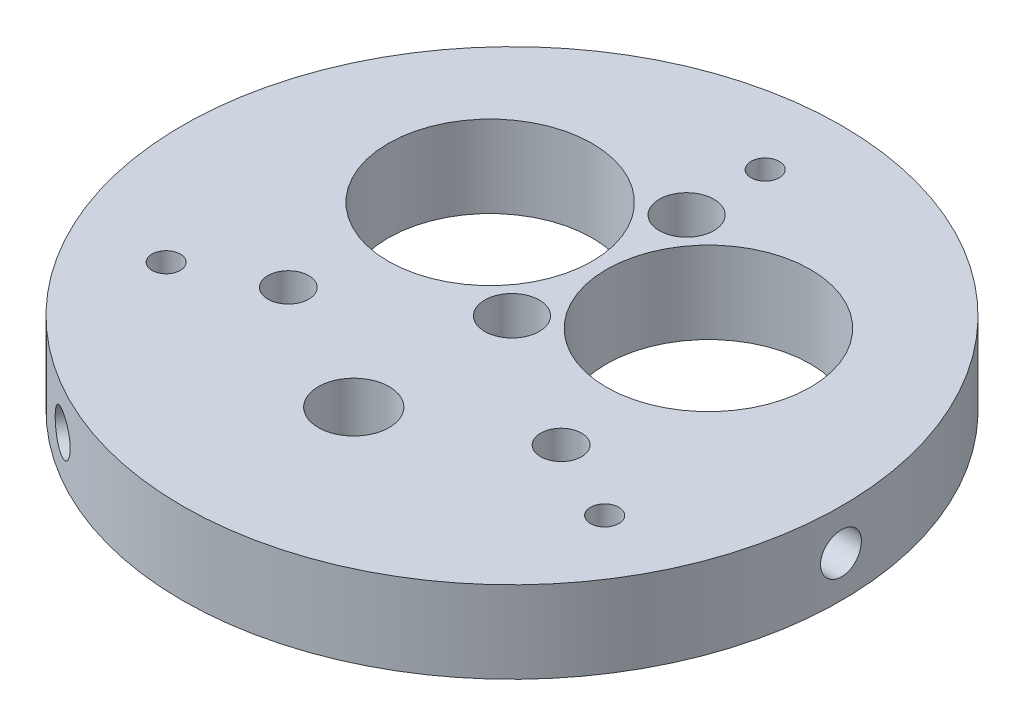
ISO-10303-21;
HEADER;
FILE_DESCRIPTION(('STEP AP214'),'2;1');
FILE_NAME('part.step','',(''),(''),'','','');
FILE_SCHEMA(('AUTOMOTIVE_DESIGN { 1 0 10303 214 1 1 1 1 }'));
ENDSEC;
DATA;
#1=APPLICATION_CONTEXT('core data for automotive mechanical design processes');
#2=APPLICATION_PROTOCOL_DEFINITION('international standard','automotive_design',2000,#1);
#3=PRODUCT_CONTEXT('',#1,'mechanical');
#4=PRODUCT('Part','Part','',(#3));
#5=PRODUCT_RELATED_PRODUCT_CATEGORY('part','',(#4));
#6=PRODUCT_DEFINITION_FORMATION('','',#4);
#7=PRODUCT_DEFINITION_CONTEXT('part definition',#1,'design');
#8=PRODUCT_DEFINITION('design','',#6,#7);
#9=PRODUCT_DEFINITION_SHAPE('','',#8);
#10=(LENGTH_UNIT() NAMED_UNIT(*) SI_UNIT(.MILLI.,.METRE.));
#11=(NAMED_UNIT(*) PLANE_ANGLE_UNIT() SI_UNIT($,.RADIAN.));
#12=(NAMED_UNIT(*) SI_UNIT($,.STERADIAN.) SOLID_ANGLE_UNIT());
#13=UNCERTAINTY_MEASURE_WITH_UNIT(LENGTH_MEASURE(1.E-05),#10,'distance_accuracy_value','');
#14=(GEOMETRIC_REPRESENTATION_CONTEXT(3) GLOBAL_UNCERTAINTY_ASSIGNED_CONTEXT((#13)) GLOBAL_UNIT_ASSIGNED_CONTEXT((#10,
#11,#12)) REPRESENTATION_CONTEXT('',''));
#15=CARTESIAN_POINT('',(0.,0.,0.));
#16=DIRECTION('',(0.,0.,1.));
#17=DIRECTION('',(1.,0.,0.));
#18=AXIS2_PLACEMENT_3D('',#15,#16,#17);
#19=CARTESIAN_POINT('',(0.,9.525,0.));
#20=DIRECTION('',(0.,-1.,0.));
#21=DIRECTION('',(0.,0.,-1.));
#22=AXIS2_PLACEMENT_3D('',#19,#20,#21);
#23=CYLINDRICAL_SURFACE('',#22,38.354);
#24=CARTESIAN_POINT('',(38.2804018525146,4.7625,-2.37489999999974));
#25=CARTESIAN_POINT('',(38.2804028373069,4.62923809089192,-2.37489413527671));
#26=CARTESIAN_POINT('',(38.2811052035353,4.49588281019358,-2.36364579205755));
#27=CARTESIAN_POINT('',(38.2838391152481,4.23285434302784,-2.31893528967399));
#28=CARTESIAN_POINT('',(38.2858722087771,4.10318562870893,-2.28544725825875));
#29=CARTESIAN_POINT('',(38.2910364070698,3.85137838047477,-2.19722280005456));
#30=CARTESIAN_POINT('',(38.2941669331792,3.72923591794559,-2.14249756959386));
#31=CARTESIAN_POINT('',(38.3011725260395,3.49590258604333,-2.01337022650416));
#32=CARTESIAN_POINT('',(38.3050474219797,3.38470921301707,-1.93897262662722));
#33=CARTESIAN_POINT('',(38.313111626275,3.17623409838296,-1.77249177631208));
#34=CARTESIAN_POINT('',(38.3173013377438,3.07897067303234,-1.68038560702491));
#35=CARTESIAN_POINT('',(38.3255193340163,2.90127312255655,-1.48114938271447));
#36=CARTESIAN_POINT('',(38.3295476120886,2.82083969861176,-1.37401870204254));
#37=CARTESIAN_POINT('',(38.3369922882502,2.67902969934687,-1.14767193856118));
#38=CARTESIAN_POINT('',(38.3404082021527,2.617668176002,-1.0284464081496));
#39=CARTESIAN_POINT('',(38.3462390227638,2.51584020554425,-0.781360599533002));
#40=CARTESIAN_POINT('',(38.3486539400257,2.47537353813936,-0.653500412378222));
#41=CARTESIAN_POINT('',(38.3522078864978,2.41653451916251,-0.392950312927358));
#42=CARTESIAN_POINT('',(38.3533485636492,2.39813362823547,-0.260266868395284));
#43=CARTESIAN_POINT('',(38.3542310483331,2.38386036623799,0.00631003831127287));
#44=CARTESIAN_POINT('',(38.3539728713895,2.38798774516191,0.14020348704137));
#45=CARTESIAN_POINT('',(38.3520881155161,2.4186303095414,0.405206350489702));
#46=CARTESIAN_POINT('',(38.3504634131721,2.44511479320974,0.536319330484336));
#47=CARTESIAN_POINT('',(38.3460306871079,2.51967212930872,0.792235044756302));
#48=CARTESIAN_POINT('',(38.3432226564961,2.56774510747139,0.917037742277648));
#49=CARTESIAN_POINT('',(38.3367362172293,2.6841495937017,1.15688876407849));
#50=CARTESIAN_POINT('',(38.3330572109929,2.75249501899231,1.27193031723763));
#51=CARTESIAN_POINT('',(38.32524287678,2.90749419472858,1.48891949069444));
#52=CARTESIAN_POINT('',(38.3211075437668,2.99414814726964,1.59086696643552));
#53=CARTESIAN_POINT('',(38.3128377790859,3.18347799568064,1.77895325879296));
#54=CARTESIAN_POINT('',(38.3087033605807,3.28618053913264,1.865065254496));
#55=CARTESIAN_POINT('',(38.3009084798889,3.50459884614974,2.01882939779021));
#56=CARTESIAN_POINT('',(38.2972480178872,3.62031461479223,2.08648153817884));
#57=CARTESIAN_POINT('',(38.2908143984836,3.8614916273744,2.20140364078515));
#58=CARTESIAN_POINT('',(38.2880412899939,3.98695340805489,2.24867247949551));
#59=CARTESIAN_POINT('',(38.2836968563364,4.24405325203897,2.32146770175652));
#60=CARTESIAN_POINT('',(38.2821255172932,4.37569124401501,2.34699433633738));
#61=CARTESIAN_POINT('',(38.2803644239049,4.64117285013254,2.37554713938441));
#62=CARTESIAN_POINT('',(38.2801723805149,4.77501244030647,2.37861058737654));
#63=CARTESIAN_POINT('',(38.2811855558711,5.04130366654735,2.36224745372679));
#64=CARTESIAN_POINT('',(38.2823907674829,5.17375530969764,2.34282098691761));
#65=CARTESIAN_POINT('',(38.2860605414527,5.43340543759909,2.282060435064));
#66=CARTESIAN_POINT('',(38.2885241171049,5.56060795394907,2.24074351377059));
#67=CARTESIAN_POINT('',(38.2944321528365,5.80627343777458,2.13739227430566));
#68=CARTESIAN_POINT('',(38.297876621647,5.92473632744399,2.07535777171928));
#69=CARTESIAN_POINT('',(38.3053638317819,6.14973108341426,1.93223701715204));
#70=CARTESIAN_POINT('',(38.3094073550205,6.25624703183816,1.85112578277772));
#71=CARTESIAN_POINT('',(38.3176342635313,6.45416396797893,1.67219038274789));
#72=CARTESIAN_POINT('',(38.3218176501481,6.54556481031257,1.57436605635746));
#73=CARTESIAN_POINT('',(38.3298595625683,6.71078288610321,1.36462091887382));
#74=CARTESIAN_POINT('',(38.3337176380872,6.7845759977581,1.25268108721998));
#75=CARTESIAN_POINT('',(38.3406677229239,6.91231883823295,1.01797818211948));
#76=CARTESIAN_POINT('',(38.343759736896,6.96626868761152,0.895215174435104));
#77=CARTESIAN_POINT('',(38.3488271428147,7.05275159763808,0.642439443840433));
#78=CARTESIAN_POINT('',(38.350803331031,7.08529993345883,0.512431963669285));
#79=CARTESIAN_POINT('',(38.3534195842414,7.12810588034382,0.248784802508676));
#80=CARTESIAN_POINT('',(38.3540596620933,7.13836370591669,0.115145156485227));
#81=CARTESIAN_POINT('',(38.3539316119804,7.13629537087301,-0.15173399741554));
#82=CARTESIAN_POINT('',(38.3531658382137,7.12400696553796,-0.284973800674045));
#83=CARTESIAN_POINT('',(38.3503168773641,7.07727325897385,-0.547494398021387));
#84=CARTESIAN_POINT('',(38.3482336879553,7.04282791862838,-0.676775185120456));
#85=CARTESIAN_POINT('',(38.3429840573992,6.9527665950289,-0.927713747359896));
#86=CARTESIAN_POINT('',(38.3398176229976,6.89715074360862,-1.04937156996476));
#87=CARTESIAN_POINT('',(38.3327570505148,6.76633244436232,-1.28162755978392));
#88=CARTESIAN_POINT('',(38.3288629314868,6.69113050934785,-1.39222601645454));
#89=CARTESIAN_POINT('',(38.3207772984907,6.52313545836678,-1.59941512264191));
#90=CARTESIAN_POINT('',(38.316585330344,6.43031510026139,-1.6959836649611));
#91=CARTESIAN_POINT('',(38.3083800523644,6.22975362752857,-1.87220132348133));
#92=CARTESIAN_POINT('',(38.3043667865182,6.1220088658622,-1.95184629201958));
#93=CARTESIAN_POINT('',(38.2969677917123,5.89453587654806,-2.0920138541689));
#94=CARTESIAN_POINT('',(38.2935828385411,5.77479311183602,-2.1525128720298));
#95=CARTESIAN_POINT('',(38.2878336952391,5.52691573865806,-2.25247359450052));
#96=CARTESIAN_POINT('',(38.285468309652,5.39879116220686,-2.29195994955248));
#97=CARTESIAN_POINT('',(38.2826463054199,5.18531841211594,-2.3385067489144));
#98=CARTESIAN_POINT('',(38.2818083941843,5.10135027860589,-2.35213658153649));
#99=CARTESIAN_POINT('',(38.2806858540897,4.9324340875067,-2.3703350709771));
#100=CARTESIAN_POINT('',(38.2804012244762,4.84748603125375,-2.37490374014977));
#101=CARTESIAN_POINT('',(38.2804018525146,4.7625,-2.37489999999974));
#102=B_SPLINE_CURVE_WITH_KNOTS('',3,(#24,#25,#26,#27,#28,#29,#30,#31,#32,#33,#34,#35,#36,#37,
#38,#39,#40,#41,#42,#43,#44,#45,#46,#47,#48,#49,#50,#51,#52,#53,#54,#55,#56,#57,#58,#59,#60,#61,
#62,#63,#64,#65,#66,#67,#68,#69,#70,#71,#72,#73,#74,#75,#76,#77,#78,#79,#80,#81,#82,#83,#84,#85,
#86,#87,#88,#89,#90,#91,#92,#93,#94,#95,#96,#97,#98,#99,#100,#101),.UNSPECIFIED.,.T.,.F.,(4,2,2,
2,2,2,2,2,2,2,2,2,2,2,2,2,2,2,2,2,2,2,2,2,2,2,2,2,2,2,2,2,2,2,2,2,2,2,4),(0.,0.399475476302926,
0.799416493165485,1.1991469454962,1.59878578090996,1.99894536307212,2.39912161357537,
2.7996128949367,3.20009995387938,3.60006847169276,4.00003255089726,4.39944827316248,
4.79886632166716,5.19855921151562,5.59825651353268,5.99862467916022,6.3989930010006,
6.79938338792528,7.19976915197735,7.59949029185473,7.99920939077927,8.39861554288699,
8.79802525035158,9.19796095582233,9.59790050781335,9.99838485314969,10.3988667652857,
10.7990625252291,11.1992544339451,11.5987768041428,11.9982998796691,12.3978204673125,
12.7973305955817,13.1974635662305,13.5976944894359,13.9984163444992,14.3986670613082,
14.6534276439034,14.908187879153),.UNSPECIFIED.);
#103=CARTESIAN_POINT('',(38.2804018525146,4.7625,-2.37489999999974));
#104=VERTEX_POINT('',#103);
#105=EDGE_CURVE('E132',#104,#104,#102,.T.);
#106=ORIENTED_EDGE('',*,*,#105,.T.);
#107=EDGE_LOOP('',(#106));
#108=FACE_BOUND('',#107,.T.);
#109=CARTESIAN_POINT('',(-17.08347719481,4.7625,34.3392504713543));
#110=CARTESIAN_POINT('',(-17.0834827662053,4.62923809089192,34.339248391848));
#111=CARTESIAN_POINT('',(-17.0935753002978,4.49588281019358,34.3342324872349));
#112=CARTESIAN_POINT('',(-17.1336626870343,4.23285434302784,34.3142448730381));
#113=CARTESIAN_POINT('',(-17.1636807197271,4.10318562870893,34.2992615679749));
#114=CARTESIAN_POINT('',(-17.2426674409134,3.85137838047477,34.2596216657845));
#115=CARTESIAN_POINT('',(-17.2916261437751,3.72923591794559,34.2349701656921));
#116=CARTESIAN_POINT('',(-17.4069564996441,3.49590258604333,34.1764735155328));
#117=CARTESIAN_POINT('',(-17.4733241590882,3.38470921301707,34.1426304739156));
#118=CARTESIAN_POINT('',(-17.6215329068524,3.17623409838296,34.066373854539));
#119=CARTESIAN_POINT('',(-17.7033940450348,3.07897067303234,34.023949166462));
#120=CARTESIAN_POINT('',(-17.8800466747779,2.90127312255656,33.9314480478469));
#121=CARTESIAN_POINT('',(-17.9748387048007,2.82083969861176,33.8813712986551));
#122=CARTESIAN_POINT('',(-18.1745830901207,2.67902969934687,33.7746451955933));
#123=CARTESIAN_POINT('',(-18.2795433851881,2.617668176002,33.7179906986042));
#124=CARTESIAN_POINT('',(-18.4964413826702,2.51584020554425,33.59949743307));
#125=CARTESIAN_POINT('',(-18.6083790115098,2.47537353813936,33.5376587191895));
#126=CARTESIAN_POINT('',(-18.8357989898289,2.4165345191625,33.4104614773926));
#127=CARTESIAN_POINT('',(-18.951276562031,2.39813362823547,33.3451076105171));
#128=CARTESIAN_POINT('',(-19.1825801776431,2.38386036623799,33.2125834113186));
#129=CARTESIAN_POINT('',(-19.2984062171719,2.38798774516191,33.1454130991617));
#130=CARTESIAN_POINT('',(-19.5269630510571,2.41863030954139,33.0112794209713));
#131=CARTESIAN_POINT('',(-19.6396978713263,2.44511479320974,32.9443158974704));
#132=CARTESIAN_POINT('',(-19.8591110180814,2.51967212930871,32.8125191869549));
#133=CARTESIAN_POINT('',(-19.9657893092898,2.56774510747139,32.7476860123498));
#134=CARTESIAN_POINT('',(-20.1702631676596,2.6841495937017,32.6221430802642));
#135=CARTESIAN_POINT('',(-20.268052572068,2.7524950189923,32.5614361908232));
#136=CARTESIAN_POINT('',(-20.4520635415213,2.90749419472858,32.4461741921528));
#137=CARTESIAN_POINT('',(-20.5382849788582,2.99414814726964,32.3916191508397));
#138=CARTESIAN_POINT('',(-20.6970376038029,3.18347799568064,32.2904141783639));
#139=CARTESIAN_POINT('',(-20.7695455703997,3.28618053913264,32.2437776690571));
#140=CARTESIAN_POINT('',(-20.8988117843378,3.50459884614974,32.1601450327115));
#141=CARTESIAN_POINT('',(-20.9555700255338,3.62031461479223,32.123148909434));
#142=CARTESIAN_POINT('',(-21.0518786761454,3.8614916273744,32.0601161802891));
#143=CARTESIAN_POINT('',(-21.0914281370312,3.98695340805489,32.0340801785344));
#144=CARTESIAN_POINT('',(-21.1522984319546,4.24405325203896,31.9939201774914));
#145=CARTESIAN_POINT('',(-21.1736194764531,4.37569124401501,31.9797960406716));
#146=CARTESIAN_POINT('',(-21.197466382547,4.64117285013254,31.9639944875354));
#147=CARTESIAN_POINT('',(-21.2000233846363,4.77501244030647,31.962296449085));
#148=CARTESIAN_POINT('',(-21.1863590828882,5.04130366654735,31.9713554515068));
#149=CARTESIAN_POINT('',(-21.1701378749316,5.17375530969764,31.9821124287841));
#150=CARTESIAN_POINT('',(-21.1193525804633,5.43340543759909,32.0156708221949));
#151=CARTESIAN_POINT('',(-21.0848028648431,5.56060795394907,32.0384628019406));
#152=CARTESIAN_POINT('',(-20.9982520838197,5.80627343777458,32.0952549307031));
#153=CARTESIAN_POINT('',(-20.946250863074,5.924736327444,32.1292551794887));
#154=CARTESIAN_POINT('',(-20.8260482588774,6.14973108341426,32.2072996709527));
#155=CARTESIAN_POINT('',(-20.7578256309963,6.25624703183816,32.2513570819853));
#156=CARTESIAN_POINT('',(-20.6069764831895,6.45416396797893,32.3479494937651));
#157=CARTESIAN_POINT('',(-20.5243498247357,6.54556481031257,32.4004845760443));
#158=CARTESIAN_POINT('',(-20.3467261635647,6.71078288610321,32.512321645237));
#159=CARTESIAN_POINT('',(-20.2517124634165,6.7845759977581,32.571632752473));
#160=CARTESIAN_POINT('',(-20.0519288276759,6.91231883823295,32.6950031550504));
#161=CARTESIAN_POINT('',(-19.9471589513623,6.96626868761152,32.7590624215412));
#162=CARTESIAN_POINT('',(-19.7307824501664,7.05275159763808,32.8898387890954));
#163=CARTESIAN_POINT('',(-19.6191807637644,7.08529993345883,32.956553958379));
#164=CARTESIAN_POINT('',(-19.3921637511688,7.12810588034382,33.0906432807022));
#165=CARTESIAN_POINT('',(-19.2767484616857,7.13836370591669,33.1580174273941));
#166=CARTESIAN_POINT('',(-19.0455603096107,7.13629537087301,33.2913461096937));
#167=CARTESIAN_POINT('',(-18.9297883683103,7.12400696553796,33.3573028317875));
#168=CARTESIAN_POINT('',(-18.701014381566,7.07727325897386,33.486095857991));
#169=CARTESIAN_POINT('',(-18.5880123410126,7.04282791862838,33.5489321565916));
#170=CARTESIAN_POINT('',(-18.368068356046,6.9527665950289,33.6698551242893));
#171=CARTESIAN_POINT('',(-18.2611263739003,6.89715074360862,33.7279418229606));
#172=CARTESIAN_POINT('',(-18.0564565002944,6.76633244436232,33.8379551827347));
#173=CARTESIAN_POINT('',(-17.9587283676843,6.69113050934784,33.8898820050665));
#174=CARTESIAN_POINT('',(-17.7752545218406,6.52313545836678,33.9864741945798));
#175=CARTESIAN_POINT('',(-17.6895277269124,6.43031510026139,34.0311281148325));
#176=CARTESIAN_POINT('',(-17.5328161190487,6.22975362752858,34.1121309649172));
#177=CARTESIAN_POINT('',(-17.4618349200879,6.1220088658622,34.1484778590114));
#178=CARTESIAN_POINT('',(-17.336746753077,5.89453587654806,34.2121539226216));
#179=CARTESIAN_POINT('',(-17.2826605901199,5.77479311183602,34.2394719761152));
#180=CARTESIAN_POINT('',(-17.1932174934286,5.52691573865806,34.2844734332011));
#181=CARTESIAN_POINT('',(-17.1578386140572,5.39879116220686,34.3021681267189));
#182=CARTESIAN_POINT('',(-17.1161169012289,5.18531841211594,34.3229975990452));
#183=CARTESIAN_POINT('',(-17.103894164311,5.10135027860589,34.3290868629402));
#184=CARTESIAN_POINT('',(-17.0875725400976,4.9324340875067,34.3372139594217));
#185=CARTESIAN_POINT('',(-17.0834736417259,4.84748603125375,34.3392517975321));
#186=CARTESIAN_POINT('',(-17.08347719481,4.7625,34.3392504713543));
#187=B_SPLINE_CURVE_WITH_KNOTS('',3,(#109,#110,#111,#112,#113,#114,#115,#116,#117,#118,#119,
#120,#121,#122,#123,#124,#125,#126,#127,#128,#129,#130,#131,#132,#133,#134,#135,#136,#137,#138,
#139,#140,#141,#142,#143,#144,#145,#146,#147,#148,#149,#150,#151,#152,#153,#154,#155,#156,#157,
#158,#159,#160,#161,#162,#163,#164,#165,#166,#167,#168,#169,#170,#171,#172,#173,#174,#175,#176,
#177,#178,#179,#180,#181,#182,#183,#184,#185,#186),.UNSPECIFIED.,.T.,.F.,(4,2,2,2,2,2,2,2,2,2,2,
2,2,2,2,2,2,2,2,2,2,2,2,2,2,2,2,2,2,2,2,2,2,2,2,2,2,2,4),(0.,0.399475476302926,
0.799416493165485,1.1991469454962,1.59878578090996,1.99894536307212,2.39912161357536,
2.7996128949367,3.20009995387938,3.60006847169275,4.00003255089726,4.39944827316247,
4.79886632166716,5.19855921151562,5.59825651353268,5.99862467916022,6.3989930010006,
6.79938338792527,7.19976915197735,7.59949029185473,7.99920939077927,8.39861554288699,
8.79802525035157,9.19796095582232,9.59790050781334,9.99838485314969,10.3988667652857,
10.7990625252291,11.1992544339451,11.5987768041428,11.9982998796691,12.3978204673125,
12.7973305955817,13.1974635662305,13.5976944894359,13.9984163444991,14.3986670613082,
14.6534276439034,14.908187879153),.UNSPECIFIED.);
#188=CARTESIAN_POINT('',(-17.08347719481,4.7625,34.3392504713543));
#189=VERTEX_POINT('',#188);
#190=EDGE_CURVE('E133',#189,#189,#187,.T.);
#191=ORIENTED_EDGE('',*,*,#190,.T.);
#192=EDGE_LOOP('',(#191));
#193=FACE_BOUND('',#192,.T.);
#194=CARTESIAN_POINT('',(-21.1969246577049,4.7625,-31.9643504713545));
#195=CARTESIAN_POINT('',(-21.1969200711019,4.62923809089192,-31.9643542565713));
#196=CARTESIAN_POINT('',(-21.1875299032378,4.49588281019358,-31.9705866951773));
#197=CARTESIAN_POINT('',(-21.1501764282141,4.23285434302784,-31.9953095833641));
#198=CARTESIAN_POINT('',(-21.1221914890503,4.10318562870893,-32.0138143097161));
#199=CARTESIAN_POINT('',(-21.0483689661567,3.85137838047477,-32.0623988657299));
#200=CARTESIAN_POINT('',(-21.0025407894044,3.72923591794559,-32.0924725960982));
#201=CARTESIAN_POINT('',(-20.8942160263957,3.49590258604333,-32.1631032890286));
#202=CARTESIAN_POINT('',(-20.8317232628918,3.38470921301707,-32.2036578472883));
#203=CARTESIAN_POINT('',(-20.6915787194229,3.17623409838296,-32.2938820782269));
#204=CARTESIAN_POINT('',(-20.6139072927094,3.07897067303234,-32.3435635594371));
#205=CARTESIAN_POINT('',(-20.4454726592387,2.90127312255655,-32.4502986651325));
#206=CARTESIAN_POINT('',(-20.3547089072882,2.82083969861176,-32.5073525966125));
#207=CARTESIAN_POINT('',(-20.1624091981298,2.67902969934687,-32.6269732570321));
#208=CARTESIAN_POINT('',(-20.0608648169649,2.617668176002,-32.6895442904546));
#209=CARTESIAN_POINT('',(-19.8497976400938,2.51584020554425,-32.818136833537));
#210=CARTESIAN_POINT('',(-19.7402749285161,2.47537353813936,-32.8841583068112));
#211=CARTESIAN_POINT('',(-19.5164088966692,2.41653451916251,-33.0175111644653));
#212=CARTESIAN_POINT('',(-19.4020720016185,2.39813362823547,-33.0848407421218));
#213=CARTESIAN_POINT('',(-19.1716508706903,2.38386036623799,-33.2188934496299));
#214=CARTESIAN_POINT('',(-19.0555666542179,2.38798774516191,-33.2856165862031));
#215=CARTESIAN_POINT('',(-18.8251250644594,2.4186303095414,-33.416485771461));
#216=CARTESIAN_POINT('',(-18.7107655418461,2.44511479320974,-33.4806352279548));
#217=CARTESIAN_POINT('',(-18.4869196690269,2.51967212930872,-33.6047542317112));
#218=CARTESIAN_POINT('',(-18.3774333472066,2.56774510747139,-33.6647237546274));
#219=CARTESIAN_POINT('',(-18.1664730495701,2.6841495937017,-33.7790318443427));
#220=CARTESIAN_POINT('',(-18.0650046389252,2.75249501899231,-33.8333665080608));
#221=CARTESIAN_POINT('',(-17.873179335259,2.90749419472859,-33.9350936828473));
#222=CARTESIAN_POINT('',(-17.7828225649089,2.99414814726964,-33.9824861172752));
#223=CARTESIAN_POINT('',(-17.6158001752833,3.18347799568064,-34.0693674371569));
#224=CARTESIAN_POINT('',(-17.5391577901813,3.28618053913264,-34.1088429235531));
#225=CARTESIAN_POINT('',(-17.4020966955515,3.50459884614974,-34.1789744305017));
#226=CARTESIAN_POINT('',(-17.3416779923536,3.62031461479223,-34.2096304476129));
#227=CARTESIAN_POINT('',(-17.2389357223385,3.8614916273744,-34.2615198210742));
#228=CARTESIAN_POINT('',(-17.1966131529631,3.98695340805489,-34.2827526580299));
#229=CARTESIAN_POINT('',(-17.1313984243821,4.24405325203897,-34.315387879248));
#230=CARTESIAN_POINT('',(-17.1085060408404,4.37569124401501,-34.326790377009));
#231=CARTESIAN_POINT('',(-17.0828980413583,4.64117285013254,-34.3395416269199));
#232=CARTESIAN_POINT('',(-17.0801489958789,4.77501244030647,-34.3409070364615));
#233=CARTESIAN_POINT('',(-17.0948264729832,5.04130366654735,-34.3336029052336));
#234=CARTESIAN_POINT('',(-17.1122528925516,5.17375530969764,-34.3249334157018));
#235=CARTESIAN_POINT('',(-17.1667079609897,5.43340543759909,-34.2977312572589));
#236=CARTESIAN_POINT('',(-17.2037212522621,5.56060795394907,-34.2792063157112));
#237=CARTESIAN_POINT('',(-17.2961800690171,5.80627343777458,-34.2326472050088));
#238=CARTESIAN_POINT('',(-17.3516257585733,5.924736327444,-34.204612951208));
#239=CARTESIAN_POINT('',(-17.4793155729048,6.14973108341426,-34.1395366881047));
#240=CARTESIAN_POINT('',(-17.5515817240246,6.25624703183816,-34.102482864763));
#241=CARTESIAN_POINT('',(-17.7106577803421,6.45416396797893,-34.020139876513));
#242=CARTESIAN_POINT('',(-17.7974678254127,6.54556481031257,-33.9748506324018));
#243=CARTESIAN_POINT('',(-17.9831333990039,6.71078288610321,-33.8769425641109));
#244=CARTESIAN_POINT('',(-18.0820051746709,6.7845759977581,-33.824313839693));
#245=CARTESIAN_POINT('',(-18.2887388952484,6.91231883823295,-33.7129813371698));
#246=CARTESIAN_POINT('',(-18.3966007855341,6.96626868761152,-33.6542775959763));
#247=CARTESIAN_POINT('',(-18.6180446926485,7.05275159763808,-33.5322782329358));
#248=CARTESIAN_POINT('',(-18.7316225672669,7.08529993345883,-33.4689859220483));
#249=CARTESIAN_POINT('',(-18.9612558330728,7.12810588034382,-33.3394280832109));
#250=CARTESIAN_POINT('',(-19.0773112004078,7.13836370591669,-33.2731625838793));
#251=CARTESIAN_POINT('',(-19.30837130237,7.13629537087301,-33.1396121122782));
#252=CARTESIAN_POINT('',(-19.4233774699037,7.12400696553796,-33.0723290311135));
#253=CARTESIAN_POINT('',(-19.6493024957984,7.07727325897385,-32.9386014599696));
#254=CARTESIAN_POINT('',(-19.760221346943,7.04282791862838,-32.8721569714712));
#255=CARTESIAN_POINT('',(-19.9749157013535,6.9527665950289,-32.7421413769294));
#256=CARTESIAN_POINT('',(-20.0786912490976,6.89715074360862,-32.6785702529958));
#257=CARTESIAN_POINT('',(-20.2763005502207,6.76633244436232,-32.5563276229508));
#258=CARTESIAN_POINT('',(-20.3701345638028,6.69113050934785,-32.4976559886119));
#259=CARTESIAN_POINT('',(-20.5455227766504,6.52313545836678,-32.3870590719379));
#260=CARTESIAN_POINT('',(-20.6270576034319,6.43031510026139,-32.3351444498714));
#261=CARTESIAN_POINT('',(-20.775563933316,6.22975362752858,-32.2399296414358));
#262=CARTESIAN_POINT('',(-20.8425318664307,6.1220088658622,-32.1966315669918));
#263=CARTESIAN_POINT('',(-20.9602210386355,5.89453587654807,-32.1201400684527));
#264=CARTESIAN_POINT('',(-21.0109222484215,5.77479311183602,-32.0869591040854));
#265=CARTESIAN_POINT('',(-21.0946162018108,5.52691573865806,-32.0319998387005));
#266=CARTESIAN_POINT('',(-21.1276296955951,5.39879116220686,-32.0102081771664));
#267=CARTESIAN_POINT('',(-21.1665294041913,5.18531841211594,-31.9844908501308));
#268=CARTESIAN_POINT('',(-21.1779142298736,5.10135027860589,-31.9769502814036));
#269=CARTESIAN_POINT('',(-21.1931133139923,4.9324340875067,-31.9668788884446));
#270=CARTESIAN_POINT('',(-21.1969275827506,4.84748603125375,-31.9643480573823));
#271=CARTESIAN_POINT('',(-21.1969246577049,4.7625,-31.9643504713545));
#272=B_SPLINE_CURVE_WITH_KNOTS('',3,(#194,#195,#196,#197,#198,#199,#200,#201,#202,#203,#204,
#205,#206,#207,#208,#209,#210,#211,#212,#213,#214,#215,#216,#217,#218,#219,#220,#221,#222,#223,
#224,#225,#226,#227,#228,#229,#230,#231,#232,#233,#234,#235,#236,#237,#238,#239,#240,#241,#242,
#243,#244,#245,#246,#247,#248,#249,#250,#251,#252,#253,#254,#255,#256,#257,#258,#259,#260,#261,
#262,#263,#264,#265,#266,#267,#268,#269,#270,#271),.UNSPECIFIED.,.T.,.F.,(4,2,2,2,2,2,2,2,2,2,2,
2,2,2,2,2,2,2,2,2,2,2,2,2,2,2,2,2,2,2,2,2,2,2,2,2,2,2,4),(0.,0.399475476302926,
0.799416493165484,1.1991469454962,1.59878578090996,1.99894536307212,2.39912161357536,
2.7996128949367,3.20009995387938,3.60006847169276,4.00003255089726,4.39944827316248,
4.79886632166716,5.19855921151562,5.59825651353268,5.99862467916022,6.3989930010006,
6.79938338792527,7.19976915197735,7.59949029185473,7.99920939077927,8.39861554288699,
8.79802525035157,9.19796095582233,9.59790050781334,9.99838485314968,10.3988667652857,
10.7990625252291,11.1992544339451,11.5987768041428,11.9982998796691,12.3978204673125,
12.7973305955817,13.1974635662305,13.5976944894359,13.9984163444991,14.3986670613082,
14.6534276439034,14.908187879153),.UNSPECIFIED.);
#273=CARTESIAN_POINT('',(-21.1969246577049,4.7625,-31.9643504713545));
#274=VERTEX_POINT('',#273);
#275=EDGE_CURVE('E11',#274,#274,#272,.T.);
#276=ORIENTED_EDGE('',*,*,#275,.T.);
#277=EDGE_LOOP('',(#276));
#278=FACE_BOUND('',#277,.T.);
#279=CARTESIAN_POINT('',(0.,9.525,0.));
#280=DIRECTION('',(0.,1.,0.));
#281=DIRECTION('',(0.,0.,1.));
#282=AXIS2_PLACEMENT_3D('',#279,#280,#281);
#283=CIRCLE('',#282,38.354);
#284=CARTESIAN_POINT('',(0.,9.525,38.354));
#285=VERTEX_POINT('',#284);
#286=EDGE_CURVE('E67',#285,#285,#283,.T.);
#287=ORIENTED_EDGE('',*,*,#286,.F.);
#288=EDGE_LOOP('',(#287));
#289=FACE_BOUND('',#288,.T.);
#290=CARTESIAN_POINT('',(0.,0.,0.));
#291=DIRECTION('',(0.,1.,0.));
#292=DIRECTION('',(0.,0.,1.));
#293=AXIS2_PLACEMENT_3D('',#290,#291,#292);
#294=CIRCLE('',#293,38.354);
#295=CARTESIAN_POINT('',(0.,0.,38.354));
#296=VERTEX_POINT('',#295);
#297=EDGE_CURVE('E71',#296,#296,#294,.T.);
#298=ORIENTED_EDGE('',*,*,#297,.T.);
#299=EDGE_LOOP('',(#298));
#300=FACE_BOUND('',#299,.T.);
#301=ADVANCED_FACE('F56',(#108,#193,#278,#289,#300),#23,.T.);
#302=CARTESIAN_POINT('',(0.,9.525,0.));
#303=DIRECTION('',(0.,1.,0.));
#304=DIRECTION('',(0.,0.,1.));
#305=AXIS2_PLACEMENT_3D('',#302,#303,#304);
#306=PLANE('',#305);
#307=CARTESIAN_POINT('',(-15.875,9.525,10.16));
#308=DIRECTION('',(0.,1.,0.));
#309=DIRECTION('',(0.,0.,1.));
#310=AXIS2_PLACEMENT_3D('',#307,#308,#309);
#311=CIRCLE('',#310,2.38125);
#312=CARTESIAN_POINT('',(-15.875,9.525,12.54125));
#313=VERTEX_POINT('',#312);
#314=EDGE_CURVE('E171',#313,#313,#311,.T.);
#315=ORIENTED_EDGE('',*,*,#314,.F.);
#316=EDGE_LOOP('',(#315));
#317=FACE_BOUND('',#316,.T.);
#318=CARTESIAN_POINT('',(15.875,9.525,10.16));
#319=DIRECTION('',(0.,1.,0.));
#320=DIRECTION('',(0.,0.,1.));
#321=AXIS2_PLACEMENT_3D('',#318,#319,#320);
#322=CIRCLE('',#321,2.38125);
#323=CARTESIAN_POINT('',(15.875,9.525,12.54125));
#324=VERTEX_POINT('',#323);
#325=EDGE_CURVE('E165',#324,#324,#322,.T.);
#326=ORIENTED_EDGE('',*,*,#325,.F.);
#327=EDGE_LOOP('',(#326));
#328=FACE_BOUND('',#327,.T.);
#329=CARTESIAN_POINT('',(0.,9.525,-29.464));
#330=DIRECTION('',(0.,1.,0.));
#331=DIRECTION('',(0.,0.,1.));
#332=AXIS2_PLACEMENT_3D('',#329,#330,#331);
#333=CIRCLE('',#332,1.651);
#334=CARTESIAN_POINT('',(0.,9.525,-27.813));
#335=VERTEX_POINT('',#334);
#336=EDGE_CURVE('E91',#335,#335,#333,.T.);
#337=ORIENTED_EDGE('',*,*,#336,.F.);
#338=EDGE_LOOP('',(#337));
#339=FACE_BOUND('',#338,.T.);
#340=CARTESIAN_POINT('',(0.,9.525,-20.32));
#341=DIRECTION('',(0.,1.,0.));
#342=DIRECTION('',(0.,0.,1.));
#343=AXIS2_PLACEMENT_3D('',#340,#341,#342);
#344=CIRCLE('',#343,3.175);
#345=CARTESIAN_POINT('',(0.,9.525,-17.145));
#346=VERTEX_POINT('',#345);
#347=EDGE_CURVE('E110',#346,#346,#344,.T.);
#348=ORIENTED_EDGE('',*,*,#347,.F.);
#349=EDGE_LOOP('',(#348));
#350=FACE_BOUND('',#349,.T.);
#351=CARTESIAN_POINT('',(12.7,9.525,-10.16));
#352=DIRECTION('',(0.,1.,0.));
#353=DIRECTION('',(0.,0.,1.));
#354=AXIS2_PLACEMENT_3D('',#351,#352,#353);
#355=CIRCLE('',#354,11.8745);
#356=CARTESIAN_POINT('',(12.7,9.525,1.7145));
#357=VERTEX_POINT('',#356);
#358=EDGE_CURVE('E104',#357,#357,#355,.T.);
#359=ORIENTED_EDGE('',*,*,#358,.F.);
#360=EDGE_LOOP('',(#359));
#361=FACE_BOUND('',#360,.T.);
#362=CARTESIAN_POINT('',(0.,9.525,0.));
#363=DIRECTION('',(0.,1.,0.));
#364=DIRECTION('',(0.,0.,1.));
#365=AXIS2_PLACEMENT_3D('',#362,#363,#364);
#366=CIRCLE('',#365,3.175);
#367=CARTESIAN_POINT('',(0.,9.525,3.175));
#368=VERTEX_POINT('',#367);
#369=EDGE_CURVE('E116',#368,#368,#366,.T.);
#370=ORIENTED_EDGE('',*,*,#369,.F.);
#371=EDGE_LOOP('',(#370));
#372=FACE_BOUND('',#371,.T.);
#373=CARTESIAN_POINT('',(-25.5165724971028,9.525,14.7320000000011));
#374=DIRECTION('',(0.,1.,0.));
#375=DIRECTION('',(0.,0.,1.));
#376=AXIS2_PLACEMENT_3D('',#373,#374,#375);
#377=CIRCLE('',#376,1.651);
#378=CARTESIAN_POINT('',(-25.5165724971028,9.525,16.3830000000011));
#379=VERTEX_POINT('',#378);
#380=EDGE_CURVE('E85',#379,#379,#377,.T.);
#381=ORIENTED_EDGE('',*,*,#380,.F.);
#382=EDGE_LOOP('',(#381));
#383=FACE_BOUND('',#382,.T.);
#384=CARTESIAN_POINT('',(25.5165724971066,9.525,14.7319999999989));
#385=DIRECTION('',(0.,1.,0.));
#386=DIRECTION('',(0.,0.,1.));
#387=AXIS2_PLACEMENT_3D('',#384,#385,#386);
#388=CIRCLE('',#387,1.651);
#389=CARTESIAN_POINT('',(25.5165724971066,9.525,16.3829999999989));
#390=VERTEX_POINT('',#389);
#391=EDGE_CURVE('E78',#390,#390,#388,.T.);
#392=ORIENTED_EDGE('',*,*,#391,.F.);
#393=EDGE_LOOP('',(#392));
#394=FACE_BOUND('',#393,.T.);
#395=CARTESIAN_POINT('',(0.,9.525,18.415));
#396=DIRECTION('',(0.,1.,0.));
#397=DIRECTION('',(0.,0.,1.));
#398=AXIS2_PLACEMENT_3D('',#395,#396,#397);
#399=CIRCLE('',#398,4.1275);
#400=CARTESIAN_POINT('',(0.,9.525,22.5425));
#401=VERTEX_POINT('',#400);
#402=EDGE_CURVE('E99',#401,#401,#399,.T.);
#403=ORIENTED_EDGE('',*,*,#402,.F.);
#404=EDGE_LOOP('',(#403));
#405=FACE_BOUND('',#404,.T.);
#406=CARTESIAN_POINT('',(-12.7,9.525,-10.16));
#407=DIRECTION('',(0.,1.,0.));
#408=DIRECTION('',(0.,0.,1.));
#409=AXIS2_PLACEMENT_3D('',#406,#407,#408);
#410=CIRCLE('',#409,11.8745);
#411=CARTESIAN_POINT('',(-12.7,9.525,1.7145));
#412=VERTEX_POINT('',#411);
#413=EDGE_CURVE('E92',#412,#412,#410,.T.);
#414=ORIENTED_EDGE('',*,*,#413,.F.);
#415=EDGE_LOOP('',(#414));
#416=FACE_BOUND('',#415,.T.);
#417=ORIENTED_EDGE('',*,*,#286,.T.);
#418=EDGE_LOOP('',(#417));
#419=FACE_BOUND('',#418,.T.);
#420=ADVANCED_FACE('F187',(#317,#328,#339,#350,#361,#372,#383,#394,#405,#416,#419),#306,.T.);
#421=CARTESIAN_POINT('',(0.,0.,0.));
#422=DIRECTION('',(0.,1.,0.));
#423=DIRECTION('',(0.,0.,1.));
#424=AXIS2_PLACEMENT_3D('',#421,#422,#423);
#425=PLANE('',#424);
#426=CARTESIAN_POINT('',(-15.875,0.,10.16));
#427=DIRECTION('',(0.,1.,0.));
#428=DIRECTION('',(0.,0.,1.));
#429=AXIS2_PLACEMENT_3D('',#426,#427,#428);
#430=CIRCLE('',#429,2.38125);
#431=CARTESIAN_POINT('',(-15.875,0.,12.54125));
#432=VERTEX_POINT('',#431);
#433=EDGE_CURVE('E141',#432,#432,#430,.T.);
#434=ORIENTED_EDGE('',*,*,#433,.T.);
#435=EDGE_LOOP('',(#434));
#436=FACE_BOUND('',#435,.T.);
#437=CARTESIAN_POINT('',(15.875,0.,10.16));
#438=DIRECTION('',(0.,1.,0.));
#439=DIRECTION('',(0.,0.,1.));
#440=AXIS2_PLACEMENT_3D('',#437,#438,#439);
#441=CIRCLE('',#440,2.38125);
#442=CARTESIAN_POINT('',(15.875,0.,12.54125));
#443=VERTEX_POINT('',#442);
#444=EDGE_CURVE('E168',#443,#443,#441,.T.);
#445=ORIENTED_EDGE('',*,*,#444,.T.);
#446=EDGE_LOOP('',(#445));
#447=FACE_BOUND('',#446,.T.);
#448=CARTESIAN_POINT('',(0.,0.,-29.464));
#449=DIRECTION('',(0.,1.,0.));
#450=DIRECTION('',(0.,0.,1.));
#451=AXIS2_PLACEMENT_3D('',#448,#449,#450);
#452=CIRCLE('',#451,1.651);
#453=CARTESIAN_POINT('',(0.,0.,-27.813));
#454=VERTEX_POINT('',#453);
#455=EDGE_CURVE('E76',#454,#454,#452,.T.);
#456=ORIENTED_EDGE('',*,*,#455,.T.);
#457=EDGE_LOOP('',(#456));
#458=FACE_BOUND('',#457,.T.);
#459=CARTESIAN_POINT('',(0.,0.,-20.32));
#460=DIRECTION('',(0.,1.,0.));
#461=DIRECTION('',(0.,0.,1.));
#462=AXIS2_PLACEMENT_3D('',#459,#460,#461);
#463=CIRCLE('',#462,3.175);
#464=CARTESIAN_POINT('',(0.,0.,-17.145));
#465=VERTEX_POINT('',#464);
#466=EDGE_CURVE('E107',#465,#465,#463,.T.);
#467=ORIENTED_EDGE('',*,*,#466,.T.);
#468=EDGE_LOOP('',(#467));
#469=FACE_BOUND('',#468,.T.);
#470=CARTESIAN_POINT('',(12.7,0.,-10.16));
#471=DIRECTION('',(0.,1.,0.));
#472=DIRECTION('',(0.,0.,1.));
#473=AXIS2_PLACEMENT_3D('',#470,#471,#472);
#474=CIRCLE('',#473,11.8745);
#475=CARTESIAN_POINT('',(12.7,0.,1.7145));
#476=VERTEX_POINT('',#475);
#477=EDGE_CURVE('E96',#476,#476,#474,.T.);
#478=ORIENTED_EDGE('',*,*,#477,.T.);
#479=EDGE_LOOP('',(#478));
#480=FACE_BOUND('',#479,.T.);
#481=CARTESIAN_POINT('',(0.,0.,0.));
#482=DIRECTION('',(0.,1.,0.));
#483=DIRECTION('',(0.,0.,1.));
#484=AXIS2_PLACEMENT_3D('',#481,#482,#483);
#485=CIRCLE('',#484,3.175);
#486=CARTESIAN_POINT('',(0.,0.,3.175));
#487=VERTEX_POINT('',#486);
#488=EDGE_CURVE('E113',#487,#487,#485,.T.);
#489=ORIENTED_EDGE('',*,*,#488,.T.);
#490=EDGE_LOOP('',(#489));
#491=FACE_BOUND('',#490,.T.);
#492=CARTESIAN_POINT('',(-25.5165724971028,0.,14.7320000000011));
#493=DIRECTION('',(0.,1.,0.));
#494=DIRECTION('',(0.,0.,1.));
#495=AXIS2_PLACEMENT_3D('',#492,#493,#494);
#496=CIRCLE('',#495,1.651);
#497=CARTESIAN_POINT('',(-25.5165724971028,0.,16.3830000000011));
#498=VERTEX_POINT('',#497);
#499=EDGE_CURVE('E88',#498,#498,#496,.T.);
#500=ORIENTED_EDGE('',*,*,#499,.T.);
#501=EDGE_LOOP('',(#500));
#502=FACE_BOUND('',#501,.T.);
#503=CARTESIAN_POINT('',(25.5165724971066,0.,14.7319999999989));
#504=DIRECTION('',(0.,1.,0.));
#505=DIRECTION('',(0.,0.,1.));
#506=AXIS2_PLACEMENT_3D('',#503,#504,#505);
#507=CIRCLE('',#506,1.651);
#508=CARTESIAN_POINT('',(25.5165724971066,0.,16.3829999999989));
#509=VERTEX_POINT('',#508);
#510=EDGE_CURVE('E81',#509,#509,#507,.T.);
#511=ORIENTED_EDGE('',*,*,#510,.T.);
#512=EDGE_LOOP('',(#511));
#513=FACE_BOUND('',#512,.T.);
#514=CARTESIAN_POINT('',(0.,0.,18.415));
#515=DIRECTION('',(0.,1.,0.));
#516=DIRECTION('',(0.,0.,1.));
#517=AXIS2_PLACEMENT_3D('',#514,#515,#516);
#518=CIRCLE('',#517,4.1275);
#519=CARTESIAN_POINT('',(0.,0.,22.5425));
#520=VERTEX_POINT('',#519);
#521=EDGE_CURVE('E82',#520,#520,#518,.T.);
#522=ORIENTED_EDGE('',*,*,#521,.T.);
#523=EDGE_LOOP('',(#522));
#524=FACE_BOUND('',#523,.T.);
#525=CARTESIAN_POINT('',(-12.7,0.,-10.16));
#526=DIRECTION('',(0.,1.,0.));
#527=DIRECTION('',(0.,0.,1.));
#528=AXIS2_PLACEMENT_3D('',#525,#526,#527);
#529=CIRCLE('',#528,11.8745);
#530=CARTESIAN_POINT('',(-12.7,0.,1.7145));
#531=VERTEX_POINT('',#530);
#532=EDGE_CURVE('E95',#531,#531,#529,.T.);
#533=ORIENTED_EDGE('',*,*,#532,.T.);
#534=EDGE_LOOP('',(#533));
#535=FACE_BOUND('',#534,.T.);
#536=ORIENTED_EDGE('',*,*,#297,.F.);
#537=EDGE_LOOP('',(#536));
#538=FACE_BOUND('',#537,.T.);
#539=ADVANCED_FACE('F177',(#436,#447,#458,#469,#480,#491,#502,#513,#524,#535,#538),#425,.F.);
#540=CARTESIAN_POINT('',(-12.7,0.,-10.16));
#541=DIRECTION('',(0.,1.,0.));
#542=DIRECTION('',(0.,0.,1.));
#543=AXIS2_PLACEMENT_3D('',#540,#541,#542);
#544=CYLINDRICAL_SURFACE('',#543,11.8745);
#545=ORIENTED_EDGE('',*,*,#532,.F.);
#546=EDGE_LOOP('',(#545));
#547=FACE_BOUND('',#546,.T.);
#548=ORIENTED_EDGE('',*,*,#413,.T.);
#549=EDGE_LOOP('',(#548));
#550=FACE_BOUND('',#549,.T.);
#551=ADVANCED_FACE('F209',(#547,#550),#544,.F.);
#552=CARTESIAN_POINT('',(0.,0.,18.415));
#553=DIRECTION('',(0.,1.,0.));
#554=DIRECTION('',(0.,0.,1.));
#555=AXIS2_PLACEMENT_3D('',#552,#553,#554);
#556=CYLINDRICAL_SURFACE('',#555,4.1275);
#557=ORIENTED_EDGE('',*,*,#521,.F.);
#558=EDGE_LOOP('',(#557));
#559=FACE_BOUND('',#558,.T.);
#560=ORIENTED_EDGE('',*,*,#402,.T.);
#561=EDGE_LOOP('',(#560));
#562=FACE_BOUND('',#561,.T.);
#563=ADVANCED_FACE('F211',(#559,#562),#556,.F.);
#564=CARTESIAN_POINT('',(25.5165724971066,0.,14.7319999999989));
#565=DIRECTION('',(0.,1.,0.));
#566=DIRECTION('',(0.,0.,1.));
#567=AXIS2_PLACEMENT_3D('',#564,#565,#566);
#568=CYLINDRICAL_SURFACE('',#567,1.651);
#569=ORIENTED_EDGE('',*,*,#510,.F.);
#570=EDGE_LOOP('',(#569));
#571=FACE_BOUND('',#570,.T.);
#572=ORIENTED_EDGE('',*,*,#391,.T.);
#573=EDGE_LOOP('',(#572));
#574=FACE_BOUND('',#573,.T.);
#575=ADVANCED_FACE('F218',(#571,#574),#568,.F.);
#576=CARTESIAN_POINT('',(-25.5165724971028,0.,14.7320000000011));
#577=DIRECTION('',(0.,1.,0.));
#578=DIRECTION('',(0.,0.,1.));
#579=AXIS2_PLACEMENT_3D('',#576,#577,#578);
#580=CYLINDRICAL_SURFACE('',#579,1.651);
#581=ORIENTED_EDGE('',*,*,#499,.F.);
#582=EDGE_LOOP('',(#581));
#583=FACE_BOUND('',#582,.T.);
#584=ORIENTED_EDGE('',*,*,#380,.T.);
#585=EDGE_LOOP('',(#584));
#586=FACE_BOUND('',#585,.T.);
#587=ADVANCED_FACE('F273',(#583,#586),#580,.F.);
#588=CARTESIAN_POINT('',(0.,0.,0.));
#589=DIRECTION('',(0.,1.,0.));
#590=DIRECTION('',(0.,0.,1.));
#591=AXIS2_PLACEMENT_3D('',#588,#589,#590);
#592=CYLINDRICAL_SURFACE('',#591,3.175);
#593=ORIENTED_EDGE('',*,*,#488,.F.);
#594=EDGE_LOOP('',(#593));
#595=FACE_BOUND('',#594,.T.);
#596=ORIENTED_EDGE('',*,*,#369,.T.);
#597=EDGE_LOOP('',(#596));
#598=FACE_BOUND('',#597,.T.);
#599=ADVANCED_FACE('F278',(#595,#598),#592,.F.);
#600=CARTESIAN_POINT('',(12.7,0.,-10.16));
#601=DIRECTION('',(0.,1.,0.));
#602=DIRECTION('',(0.,0.,1.));
#603=AXIS2_PLACEMENT_3D('',#600,#601,#602);
#604=CYLINDRICAL_SURFACE('',#603,11.8745);
#605=ORIENTED_EDGE('',*,*,#477,.F.);
#606=EDGE_LOOP('',(#605));
#607=FACE_BOUND('',#606,.T.);
#608=ORIENTED_EDGE('',*,*,#358,.T.);
#609=EDGE_LOOP('',(#608));
#610=FACE_BOUND('',#609,.T.);
#611=ADVANCED_FACE('F283',(#607,#610),#604,.F.);
#612=CARTESIAN_POINT('',(0.,0.,-20.32));
#613=DIRECTION('',(0.,1.,0.));
#614=DIRECTION('',(0.,0.,1.));
#615=AXIS2_PLACEMENT_3D('',#612,#613,#614);
#616=CYLINDRICAL_SURFACE('',#615,3.175);
#617=ORIENTED_EDGE('',*,*,#466,.F.);
#618=EDGE_LOOP('',(#617));
#619=FACE_BOUND('',#618,.T.);
#620=ORIENTED_EDGE('',*,*,#347,.T.);
#621=EDGE_LOOP('',(#620));
#622=FACE_BOUND('',#621,.T.);
#623=ADVANCED_FACE('F290',(#619,#622),#616,.F.);
#624=CARTESIAN_POINT('',(0.,0.,-29.464));
#625=DIRECTION('',(0.,1.,0.));
#626=DIRECTION('',(0.,0.,1.));
#627=AXIS2_PLACEMENT_3D('',#624,#625,#626);
#628=CYLINDRICAL_SURFACE('',#627,1.651);
#629=ORIENTED_EDGE('',*,*,#455,.F.);
#630=EDGE_LOOP('',(#629));
#631=FACE_BOUND('',#630,.T.);
#632=ORIENTED_EDGE('',*,*,#336,.T.);
#633=EDGE_LOOP('',(#632));
#634=FACE_BOUND('',#633,.T.);
#635=ADVANCED_FACE('F296',(#631,#634),#628,.F.);
#636=CARTESIAN_POINT('',(-16.0019999999999,4.7625,-27.7162770227172));
#637=DIRECTION('',(-0.499999999999998,0.,-0.86602540378444));
#638=DIRECTION('',(-0.86602540378444,0.,0.499999999999998));
#639=AXIS2_PLACEMENT_3D('',#636,#637,#638);
#640=CYLINDRICAL_SURFACE('',#639,2.3749);
#641=CARTESIAN_POINT('',(-16.0019999999999,4.7625,-27.7162770227172));
#642=DIRECTION('',(-0.499999999999998,0.,-0.86602540378444));
#643=DIRECTION('',(-0.86602540378444,0.,0.499999999999998));
#644=AXIS2_PLACEMENT_3D('',#641,#642,#643);
#645=CIRCLE('',#644,2.3749);
#646=CARTESIAN_POINT('',(-18.0587237314476,4.7625,-26.5288270227172));
#647=VERTEX_POINT('',#646);
#648=EDGE_CURVE('E119',#647,#647,#645,.T.);
#649=ORIENTED_EDGE('',*,*,#648,.F.);
#650=EDGE_LOOP('',(#649));
#651=FACE_BOUND('',#650,.T.);
#652=ORIENTED_EDGE('',*,*,#275,.F.);
#653=EDGE_LOOP('',(#652));
#654=FACE_BOUND('',#653,.T.);
#655=ADVANCED_FACE('F302',(#651,#654),#640,.F.);
#656=CARTESIAN_POINT('',(-16.0019999999999,4.7625,-27.7162770227172));
#657=DIRECTION('',(-0.499999999999998,0.,-0.86602540378444));
#658=DIRECTION('',(-0.86602540378444,0.,0.499999999999998));
#659=AXIS2_PLACEMENT_3D('',#656,#657,#658);
#660=PLANE('',#659);
#661=ORIENTED_EDGE('',*,*,#648,.T.);
#662=EDGE_LOOP('',(#661));
#663=FACE_BOUND('',#662,.T.);
#664=ADVANCED_FACE('F150',(#663),#660,.T.);
#665=CARTESIAN_POINT('',(-16.0020000000003,4.7625,27.716277022717));
#666=DIRECTION('',(-0.50000000000001,0.,0.866025403784433));
#667=DIRECTION('',(0.866025403784433,0.,0.50000000000001));
#668=AXIS2_PLACEMENT_3D('',#665,#666,#667);
#669=CYLINDRICAL_SURFACE('',#668,2.3749);
#670=CARTESIAN_POINT('',(-16.0020000000003,4.7625,27.716277022717));
#671=DIRECTION('',(-0.50000000000001,0.,0.866025403784433));
#672=DIRECTION('',(0.866025403784433,0.,0.50000000000001));
#673=AXIS2_PLACEMENT_3D('',#670,#671,#672);
#674=CIRCLE('',#673,2.3749);
#675=CARTESIAN_POINT('',(-13.9452762685527,4.7625,28.903727022717));
#676=VERTEX_POINT('',#675);
#677=EDGE_CURVE('E129',#676,#676,#674,.T.);
#678=ORIENTED_EDGE('',*,*,#677,.F.);
#679=EDGE_LOOP('',(#678));
#680=FACE_BOUND('',#679,.T.);
#681=ORIENTED_EDGE('',*,*,#190,.F.);
#682=EDGE_LOOP('',(#681));
#683=FACE_BOUND('',#682,.T.);
#684=ADVANCED_FACE('F145',(#680,#683),#669,.F.);
#685=CARTESIAN_POINT('',(-16.0020000000003,4.7625,27.716277022717));
#686=DIRECTION('',(-0.50000000000001,0.,0.866025403784433));
#687=DIRECTION('',(0.866025403784433,0.,0.50000000000001));
#688=AXIS2_PLACEMENT_3D('',#685,#686,#687);
#689=PLANE('',#688);
#690=ORIENTED_EDGE('',*,*,#677,.T.);
#691=EDGE_LOOP('',(#690));
#692=FACE_BOUND('',#691,.T.);
#693=ADVANCED_FACE('F149',(#692),#689,.T.);
#694=CARTESIAN_POINT('',(32.004,4.7625,2.22044604925031E-13));
#695=DIRECTION('',(1.,0.,0.));
#696=DIRECTION('',(0.,0.,-1.));
#697=AXIS2_PLACEMENT_3D('',#694,#695,#696);
#698=CYLINDRICAL_SURFACE('',#697,2.3749);
#699=CARTESIAN_POINT('',(32.004,4.7625,2.22044604925031E-13));
#700=DIRECTION('',(1.,0.,0.));
#701=DIRECTION('',(0.,0.,-1.));
#702=AXIS2_PLACEMENT_3D('',#699,#700,#701);
#703=CIRCLE('',#702,2.3749);
#704=CARTESIAN_POINT('',(32.004,4.7625,-2.37489999999978));
#705=VERTEX_POINT('',#704);
#706=EDGE_CURVE('E128',#705,#705,#703,.T.);
#707=ORIENTED_EDGE('',*,*,#706,.F.);
#708=EDGE_LOOP('',(#707));
#709=FACE_BOUND('',#708,.T.);
#710=ORIENTED_EDGE('',*,*,#105,.F.);
#711=EDGE_LOOP('',(#710));
#712=FACE_BOUND('',#711,.T.);
#713=ADVANCED_FACE('F154',(#709,#712),#698,.F.);
#714=CARTESIAN_POINT('',(32.004,4.7625,2.22044604925031E-13));
#715=DIRECTION('',(1.,0.,0.));
#716=DIRECTION('',(0.,0.,-1.));
#717=AXIS2_PLACEMENT_3D('',#714,#715,#716);
#718=PLANE('',#717);
#719=ORIENTED_EDGE('',*,*,#706,.T.);
#720=EDGE_LOOP('',(#719));
#721=FACE_BOUND('',#720,.T.);
#722=ADVANCED_FACE('F237',(#721),#718,.T.);
#723=CARTESIAN_POINT('',(15.875,0.,10.16));
#724=DIRECTION('',(0.,1.,0.));
#725=DIRECTION('',(0.,0.,1.));
#726=AXIS2_PLACEMENT_3D('',#723,#724,#725);
#727=CYLINDRICAL_SURFACE('',#726,2.38125);
#728=ORIENTED_EDGE('',*,*,#444,.F.);
#729=EDGE_LOOP('',(#728));
#730=FACE_BOUND('',#729,.T.);
#731=ORIENTED_EDGE('',*,*,#325,.T.);
#732=EDGE_LOOP('',(#731));
#733=FACE_BOUND('',#732,.T.);
#734=ADVANCED_FACE('F183',(#730,#733),#727,.F.);
#735=CARTESIAN_POINT('',(-15.875,0.,10.16));
#736=DIRECTION('',(0.,1.,0.));
#737=DIRECTION('',(0.,0.,1.));
#738=AXIS2_PLACEMENT_3D('',#735,#736,#737);
#739=CYLINDRICAL_SURFACE('',#738,2.38125);
#740=ORIENTED_EDGE('',*,*,#433,.F.);
#741=EDGE_LOOP('',(#740));
#742=FACE_BOUND('',#741,.T.);
#743=ORIENTED_EDGE('',*,*,#314,.T.);
#744=EDGE_LOOP('',(#743));
#745=FACE_BOUND('',#744,.T.);
#746=ADVANCED_FACE('F180',(#742,#745),#739,.F.);
#747=CLOSED_SHELL('',(#301,#420,#539,#551,#563,#575,#587,#599,#611,#623,#635,#655,#664,#684,
#693,#713,#722,#734,#746));
#748=MANIFOLD_SOLID_BREP('B2',#747);
#749=ADVANCED_BREP_SHAPE_REPRESENTATION('',(#18,#748),#14);
#750=SHAPE_DEFINITION_REPRESENTATION(#9,#749);
ENDSEC;
END-ISO-10303-21;
